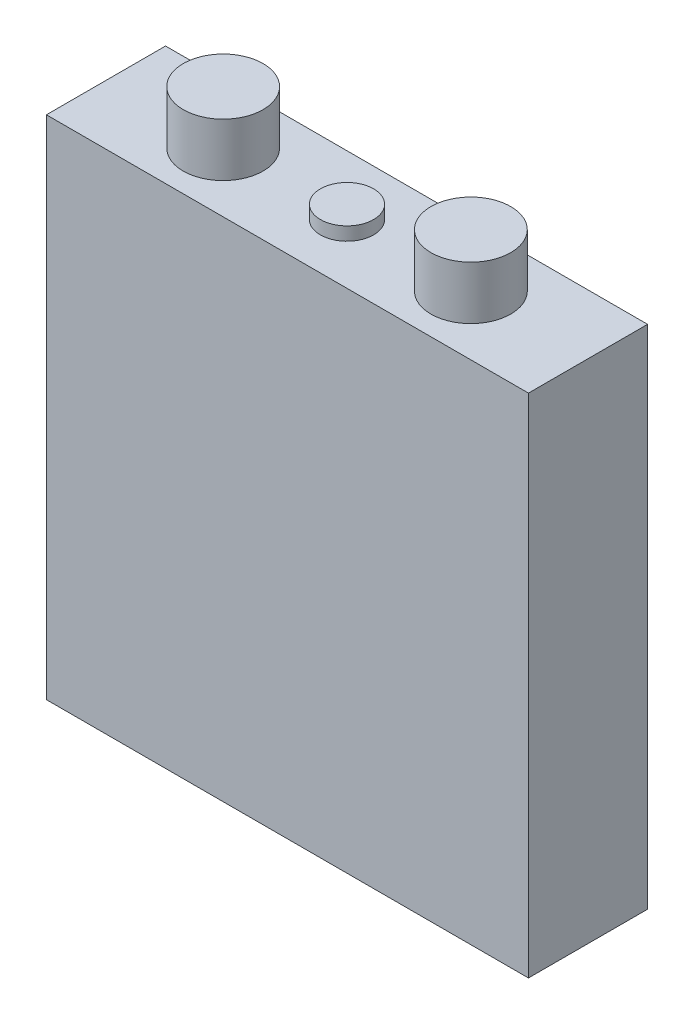
ISO-10303-21;
HEADER;
FILE_DESCRIPTION(('STEP AP214'),'2;1');
FILE_NAME('part.step','',(''),(''),'','','');
FILE_SCHEMA(('AUTOMOTIVE_DESIGN { 1 0 10303 214 1 1 1 1 }'));
ENDSEC;
DATA;
#1=APPLICATION_CONTEXT('core data for automotive mechanical design processes');
#2=APPLICATION_PROTOCOL_DEFINITION('international standard','automotive_design',2000,#1);
#3=PRODUCT_CONTEXT('',#1,'mechanical');
#4=PRODUCT('Part','Part','',(#3));
#5=PRODUCT_RELATED_PRODUCT_CATEGORY('part','',(#4));
#6=PRODUCT_DEFINITION_FORMATION('','',#4);
#7=PRODUCT_DEFINITION_CONTEXT('part definition',#1,'design');
#8=PRODUCT_DEFINITION('design','',#6,#7);
#9=PRODUCT_DEFINITION_SHAPE('','',#8);
#10=(LENGTH_UNIT() NAMED_UNIT(*) SI_UNIT(.MILLI.,.METRE.));
#11=(NAMED_UNIT(*) PLANE_ANGLE_UNIT() SI_UNIT($,.RADIAN.));
#12=(NAMED_UNIT(*) SI_UNIT($,.STERADIAN.) SOLID_ANGLE_UNIT());
#13=UNCERTAINTY_MEASURE_WITH_UNIT(LENGTH_MEASURE(1.E-05),#10,'distance_accuracy_value','');
#14=(GEOMETRIC_REPRESENTATION_CONTEXT(3) GLOBAL_UNCERTAINTY_ASSIGNED_CONTEXT((#13)) GLOBAL_UNIT_ASSIGNED_CONTEXT((#10,
#11,#12)) REPRESENTATION_CONTEXT('',''));
#15=CARTESIAN_POINT('',(0.,0.,0.));
#16=DIRECTION('',(0.,0.,1.));
#17=DIRECTION('',(1.,0.,0.));
#18=AXIS2_PLACEMENT_3D('',#15,#16,#17);
#19=CARTESIAN_POINT('',(69.0118,145.034,-17.0561));
#20=DIRECTION('',(-1.,0.,0.));
#21=DIRECTION('',(0.,0.,1.));
#22=AXIS2_PLACEMENT_3D('',#19,#20,#21);
#23=PLANE('',#22);
#24=DIRECTION('',(0.,0.,-1.));
#25=VECTOR('',#24,1.);
#26=CARTESIAN_POINT('',(69.0118,0.,-17.0561));
#27=LINE('',#26,#25);
#28=CARTESIAN_POINT('',(69.0118,0.,17.0561));
#29=VERTEX_POINT('',#28);
#30=CARTESIAN_POINT('',(69.0118,0.,-17.0561));
#31=VERTEX_POINT('',#30);
#32=EDGE_CURVE('E99',#29,#31,#27,.T.);
#33=ORIENTED_EDGE('',*,*,#32,.T.);
#34=DIRECTION('',(0.,-1.,0.));
#35=VECTOR('',#34,1.);
#36=CARTESIAN_POINT('',(69.0118,145.034,-17.0561));
#37=LINE('',#36,#35);
#38=CARTESIAN_POINT('',(69.0118,145.034,-17.0561));
#39=VERTEX_POINT('',#38);
#40=EDGE_CURVE('E11',#39,#31,#37,.T.);
#41=ORIENTED_EDGE('',*,*,#40,.F.);
#42=DIRECTION('',(0.,0.,-1.));
#43=VECTOR('',#42,1.);
#44=CARTESIAN_POINT('',(69.0118,145.034,-17.0561));
#45=LINE('',#44,#43);
#46=CARTESIAN_POINT('',(69.0118,145.034,17.0561));
#47=VERTEX_POINT('',#46);
#48=EDGE_CURVE('E87',#47,#39,#45,.T.);
#49=ORIENTED_EDGE('',*,*,#48,.F.);
#50=DIRECTION('',(0.,-1.,0.));
#51=VECTOR('',#50,1.);
#52=CARTESIAN_POINT('',(69.0118,145.034,17.0561));
#53=LINE('',#52,#51);
#54=EDGE_CURVE('E95',#47,#29,#53,.T.);
#55=ORIENTED_EDGE('',*,*,#54,.T.);
#56=EDGE_LOOP('',(#33,#41,#49,#55));
#57=FACE_BOUND('',#56,.T.);
#58=ADVANCED_FACE('F36',(#57),#23,.F.);
#59=CARTESIAN_POINT('',(-69.0118,145.034,-17.0561));
#60=DIRECTION('',(0.,0.,1.));
#61=DIRECTION('',(1.,0.,0.));
#62=AXIS2_PLACEMENT_3D('',#59,#60,#61);
#63=PLANE('',#62);
#64=DIRECTION('',(-1.,0.,0.));
#65=VECTOR('',#64,1.);
#66=CARTESIAN_POINT('',(-69.0118,0.,-17.0561));
#67=LINE('',#66,#65);
#68=CARTESIAN_POINT('',(-69.0118,0.,-17.0561));
#69=VERTEX_POINT('',#68);
#70=EDGE_CURVE('E91',#31,#69,#67,.T.);
#71=ORIENTED_EDGE('',*,*,#70,.T.);
#72=DIRECTION('',(0.,-1.,0.));
#73=VECTOR('',#72,1.);
#74=CARTESIAN_POINT('',(-69.0118,145.034,-17.0561));
#75=LINE('',#74,#73);
#76=CARTESIAN_POINT('',(-69.0118,145.034,-17.0561));
#77=VERTEX_POINT('',#76);
#78=EDGE_CURVE('E44',#77,#69,#75,.T.);
#79=ORIENTED_EDGE('',*,*,#78,.F.);
#80=DIRECTION('',(-1.,0.,0.));
#81=VECTOR('',#80,1.);
#82=CARTESIAN_POINT('',(-69.0118,145.034,-17.0561));
#83=LINE('',#82,#81);
#84=EDGE_CURVE('E82',#39,#77,#83,.T.);
#85=ORIENTED_EDGE('',*,*,#84,.F.);
#86=ORIENTED_EDGE('',*,*,#40,.T.);
#87=EDGE_LOOP('',(#71,#79,#85,#86));
#88=FACE_BOUND('',#87,.T.);
#89=ADVANCED_FACE('F90',(#88),#63,.F.);
#90=CARTESIAN_POINT('',(-69.0118,145.034,-17.0561));
#91=DIRECTION('',(1.,0.,0.));
#92=DIRECTION('',(0.,0.,-1.));
#93=AXIS2_PLACEMENT_3D('',#90,#91,#92);
#94=PLANE('',#93);
#95=DIRECTION('',(0.,0.,1.));
#96=VECTOR('',#95,1.);
#97=CARTESIAN_POINT('',(-69.0118,0.,-17.0561));
#98=LINE('',#97,#96);
#99=CARTESIAN_POINT('',(-69.0118,0.,17.0561));
#100=VERTEX_POINT('',#99);
#101=EDGE_CURVE('E69',#69,#100,#98,.T.);
#102=ORIENTED_EDGE('',*,*,#101,.T.);
#103=DIRECTION('',(0.,-1.,0.));
#104=VECTOR('',#103,1.);
#105=CARTESIAN_POINT('',(-69.0118,145.034,17.0561));
#106=LINE('',#105,#104);
#107=CARTESIAN_POINT('',(-69.0118,145.034,17.0561));
#108=VERTEX_POINT('',#107);
#109=EDGE_CURVE('E92',#108,#100,#106,.T.);
#110=ORIENTED_EDGE('',*,*,#109,.F.);
#111=DIRECTION('',(0.,0.,1.));
#112=VECTOR('',#111,1.);
#113=CARTESIAN_POINT('',(-69.0118,145.034,-17.0561));
#114=LINE('',#113,#112);
#115=EDGE_CURVE('E85',#77,#108,#114,.T.);
#116=ORIENTED_EDGE('',*,*,#115,.F.);
#117=ORIENTED_EDGE('',*,*,#78,.T.);
#118=EDGE_LOOP('',(#102,#110,#116,#117));
#119=FACE_BOUND('',#118,.T.);
#120=ADVANCED_FACE('F93',(#119),#94,.F.);
#121=CARTESIAN_POINT('',(-69.0118,145.034,17.0561));
#122=DIRECTION('',(0.,0.,-1.));
#123=DIRECTION('',(-1.,0.,0.));
#124=AXIS2_PLACEMENT_3D('',#121,#122,#123);
#125=PLANE('',#124);
#126=DIRECTION('',(1.,0.,0.));
#127=VECTOR('',#126,1.);
#128=CARTESIAN_POINT('',(-69.0118,0.,17.0561));
#129=LINE('',#128,#127);
#130=EDGE_CURVE('E75',#100,#29,#129,.T.);
#131=ORIENTED_EDGE('',*,*,#130,.T.);
#132=ORIENTED_EDGE('',*,*,#54,.F.);
#133=DIRECTION('',(1.,0.,0.));
#134=VECTOR('',#133,1.);
#135=CARTESIAN_POINT('',(-69.0118,145.034,17.0561));
#136=LINE('',#135,#134);
#137=EDGE_CURVE('E52',#108,#47,#136,.T.);
#138=ORIENTED_EDGE('',*,*,#137,.F.);
#139=ORIENTED_EDGE('',*,*,#109,.T.);
#140=EDGE_LOOP('',(#131,#132,#138,#139));
#141=FACE_BOUND('',#140,.T.);
#142=ADVANCED_FACE('F107',(#141),#125,.F.);
#143=CARTESIAN_POINT('',(0.,145.034,0.));
#144=DIRECTION('',(0.,1.,0.));
#145=DIRECTION('',(0.,0.,1.));
#146=AXIS2_PLACEMENT_3D('',#143,#144,#145);
#147=PLANE('',#146);
#148=CARTESIAN_POINT('',(0.,145.034,0.));
#149=DIRECTION('',(0.,1.,0.));
#150=DIRECTION('',(0.,0.,1.));
#151=AXIS2_PLACEMENT_3D('',#148,#149,#150);
#152=CIRCLE('',#151,7.62);
#153=CARTESIAN_POINT('',(0.,145.034,7.62));
#154=VERTEX_POINT('',#153);
#155=EDGE_CURVE('E125',#154,#154,#152,.T.);
#156=ORIENTED_EDGE('',*,*,#155,.F.);
#157=EDGE_LOOP('',(#156));
#158=FACE_BOUND('',#157,.T.);
#159=CARTESIAN_POINT('',(35.4584,145.034,0.));
#160=DIRECTION('',(0.,1.,0.));
#161=DIRECTION('',(0.,0.,1.));
#162=AXIS2_PLACEMENT_3D('',#159,#160,#161);
#163=CIRCLE('',#162,11.43);
#164=CARTESIAN_POINT('',(35.4584,145.034,11.43));
#165=VERTEX_POINT('',#164);
#166=EDGE_CURVE('E119',#165,#165,#163,.T.);
#167=ORIENTED_EDGE('',*,*,#166,.F.);
#168=EDGE_LOOP('',(#167));
#169=FACE_BOUND('',#168,.T.);
#170=CARTESIAN_POINT('',(-35.4584,145.034,0.));
#171=DIRECTION('',(0.,1.,0.));
#172=DIRECTION('',(0.,0.,1.));
#173=AXIS2_PLACEMENT_3D('',#170,#171,#172);
#174=CIRCLE('',#173,11.43);
#175=CARTESIAN_POINT('',(-35.4584,145.034,11.43));
#176=VERTEX_POINT('',#175);
#177=EDGE_CURVE('E113',#176,#176,#174,.T.);
#178=ORIENTED_EDGE('',*,*,#177,.F.);
#179=EDGE_LOOP('',(#178));
#180=FACE_BOUND('',#179,.T.);
#181=ORIENTED_EDGE('',*,*,#48,.T.);
#182=ORIENTED_EDGE('',*,*,#84,.T.);
#183=ORIENTED_EDGE('',*,*,#115,.T.);
#184=ORIENTED_EDGE('',*,*,#137,.T.);
#185=EDGE_LOOP('',(#181,#182,#183,#184));
#186=FACE_BOUND('',#185,.T.);
#187=ADVANCED_FACE('F83',(#158,#169,#180,#186),#147,.T.);
#188=CARTESIAN_POINT('',(0.,0.,0.));
#189=DIRECTION('',(0.,1.,0.));
#190=DIRECTION('',(0.,0.,1.));
#191=AXIS2_PLACEMENT_3D('',#188,#189,#190);
#192=PLANE('',#191);
#193=ORIENTED_EDGE('',*,*,#32,.F.);
#194=ORIENTED_EDGE('',*,*,#130,.F.);
#195=ORIENTED_EDGE('',*,*,#101,.F.);
#196=ORIENTED_EDGE('',*,*,#70,.F.);
#197=EDGE_LOOP('',(#193,#194,#195,#196));
#198=FACE_BOUND('',#197,.T.);
#199=ADVANCED_FACE('F110',(#198),#192,.F.);
#200=CARTESIAN_POINT('',(-35.4584,160.274,0.));
#201=DIRECTION('',(0.,-1.,0.));
#202=DIRECTION('',(0.,0.,-1.));
#203=AXIS2_PLACEMENT_3D('',#200,#201,#202);
#204=CYLINDRICAL_SURFACE('',#203,11.43);
#205=CARTESIAN_POINT('',(-35.4584,160.274,0.));
#206=DIRECTION('',(0.,1.,0.));
#207=DIRECTION('',(0.,0.,1.));
#208=AXIS2_PLACEMENT_3D('',#205,#206,#207);
#209=CIRCLE('',#208,11.43);
#210=CARTESIAN_POINT('',(-35.4584,160.274,11.43));
#211=VERTEX_POINT('',#210);
#212=EDGE_CURVE('E102',#211,#211,#209,.T.);
#213=ORIENTED_EDGE('',*,*,#212,.F.);
#214=EDGE_LOOP('',(#213));
#215=FACE_BOUND('',#214,.T.);
#216=ORIENTED_EDGE('',*,*,#177,.T.);
#217=EDGE_LOOP('',(#216));
#218=FACE_BOUND('',#217,.T.);
#219=ADVANCED_FACE('F147',(#215,#218),#204,.T.);
#220=CARTESIAN_POINT('',(-35.4584,160.274,0.));
#221=DIRECTION('',(0.,1.,0.));
#222=DIRECTION('',(0.,0.,1.));
#223=AXIS2_PLACEMENT_3D('',#220,#221,#222);
#224=PLANE('',#223);
#225=ORIENTED_EDGE('',*,*,#212,.T.);
#226=EDGE_LOOP('',(#225));
#227=FACE_BOUND('',#226,.T.);
#228=ADVANCED_FACE('F149',(#227),#224,.T.);
#229=CARTESIAN_POINT('',(35.4584,160.274,0.));
#230=DIRECTION('',(0.,-1.,0.));
#231=DIRECTION('',(0.,0.,-1.));
#232=AXIS2_PLACEMENT_3D('',#229,#230,#231);
#233=CYLINDRICAL_SURFACE('',#232,11.43);
#234=CARTESIAN_POINT('',(35.4584,160.274,0.));
#235=DIRECTION('',(0.,1.,0.));
#236=DIRECTION('',(0.,0.,1.));
#237=AXIS2_PLACEMENT_3D('',#234,#235,#236);
#238=CIRCLE('',#237,11.43);
#239=CARTESIAN_POINT('',(35.4584,160.274,11.43));
#240=VERTEX_POINT('',#239);
#241=EDGE_CURVE('E116',#240,#240,#238,.T.);
#242=ORIENTED_EDGE('',*,*,#241,.F.);
#243=EDGE_LOOP('',(#242));
#244=FACE_BOUND('',#243,.T.);
#245=ORIENTED_EDGE('',*,*,#166,.T.);
#246=EDGE_LOOP('',(#245));
#247=FACE_BOUND('',#246,.T.);
#248=ADVANCED_FACE('F156',(#244,#247),#233,.T.);
#249=CARTESIAN_POINT('',(35.4584,160.274,0.));
#250=DIRECTION('',(0.,1.,0.));
#251=DIRECTION('',(0.,0.,1.));
#252=AXIS2_PLACEMENT_3D('',#249,#250,#251);
#253=PLANE('',#252);
#254=ORIENTED_EDGE('',*,*,#241,.T.);
#255=EDGE_LOOP('',(#254));
#256=FACE_BOUND('',#255,.T.);
#257=ADVANCED_FACE('F136',(#256),#253,.T.);
#258=CARTESIAN_POINT('',(0.,148.844,0.));
#259=DIRECTION('',(0.,-1.,0.));
#260=DIRECTION('',(0.,0.,-1.));
#261=AXIS2_PLACEMENT_3D('',#258,#259,#260);
#262=CYLINDRICAL_SURFACE('',#261,7.62);
#263=CARTESIAN_POINT('',(0.,148.844,0.));
#264=DIRECTION('',(0.,1.,0.));
#265=DIRECTION('',(0.,0.,1.));
#266=AXIS2_PLACEMENT_3D('',#263,#264,#265);
#267=CIRCLE('',#266,7.62);
#268=CARTESIAN_POINT('',(0.,148.844,7.62));
#269=VERTEX_POINT('',#268);
#270=EDGE_CURVE('E122',#269,#269,#267,.T.);
#271=ORIENTED_EDGE('',*,*,#270,.F.);
#272=EDGE_LOOP('',(#271));
#273=FACE_BOUND('',#272,.T.);
#274=ORIENTED_EDGE('',*,*,#155,.T.);
#275=EDGE_LOOP('',(#274));
#276=FACE_BOUND('',#275,.T.);
#277=ADVANCED_FACE('F133',(#273,#276),#262,.T.);
#278=CARTESIAN_POINT('',(0.,148.844,0.));
#279=DIRECTION('',(0.,1.,0.));
#280=DIRECTION('',(0.,0.,1.));
#281=AXIS2_PLACEMENT_3D('',#278,#279,#280);
#282=PLANE('',#281);
#283=ORIENTED_EDGE('',*,*,#270,.T.);
#284=EDGE_LOOP('',(#283));
#285=FACE_BOUND('',#284,.T.);
#286=ADVANCED_FACE('F131',(#285),#282,.T.);
#287=CLOSED_SHELL('',(#58,#89,#120,#142,#187,#199,#219,#228,#248,#257,#277,#286));
#288=MANIFOLD_SOLID_BREP('B2',#287);
#289=ADVANCED_BREP_SHAPE_REPRESENTATION('',(#18,#288),#14);
#290=SHAPE_DEFINITION_REPRESENTATION(#9,#289);
ENDSEC;
END-ISO-10303-21;
